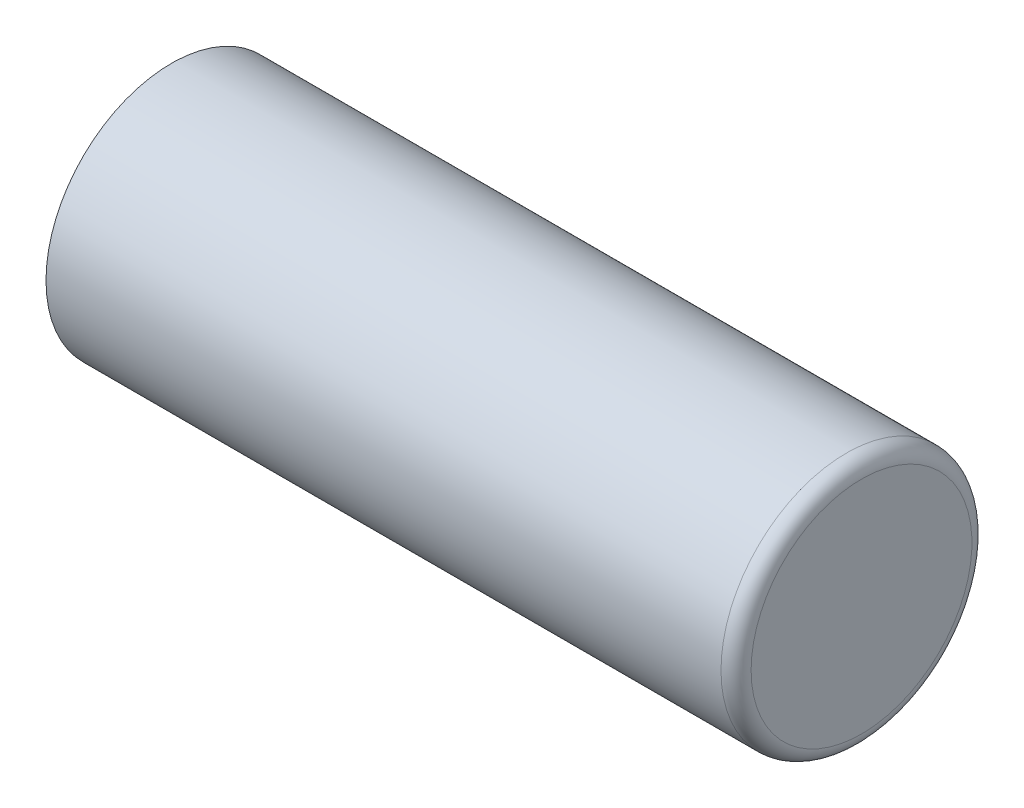
ISO-10303-21;
HEADER;
FILE_DESCRIPTION(('STEP AP214'),'2;1');
FILE_NAME('part.step','',(''),(''),'','','');
FILE_SCHEMA(('AUTOMOTIVE_DESIGN { 1 0 10303 214 1 1 1 1 }'));
ENDSEC;
DATA;
#1=APPLICATION_CONTEXT('core data for automotive mechanical design processes');
#2=APPLICATION_PROTOCOL_DEFINITION('international standard','automotive_design',2000,#1);
#3=PRODUCT_CONTEXT('',#1,'mechanical');
#4=PRODUCT('Part','Part','',(#3));
#5=PRODUCT_RELATED_PRODUCT_CATEGORY('part','',(#4));
#6=PRODUCT_DEFINITION_FORMATION('','',#4);
#7=PRODUCT_DEFINITION_CONTEXT('part definition',#1,'design');
#8=PRODUCT_DEFINITION('design','',#6,#7);
#9=PRODUCT_DEFINITION_SHAPE('','',#8);
#10=(LENGTH_UNIT() NAMED_UNIT(*) SI_UNIT(.MILLI.,.METRE.));
#11=(NAMED_UNIT(*) PLANE_ANGLE_UNIT() SI_UNIT($,.RADIAN.));
#12=(NAMED_UNIT(*) SI_UNIT($,.STERADIAN.) SOLID_ANGLE_UNIT());
#13=UNCERTAINTY_MEASURE_WITH_UNIT(LENGTH_MEASURE(1.E-05),#10,'distance_accuracy_value','');
#14=(GEOMETRIC_REPRESENTATION_CONTEXT(3) GLOBAL_UNCERTAINTY_ASSIGNED_CONTEXT((#13)) GLOBAL_UNIT_ASSIGNED_CONTEXT((#10,
#11,#12)) REPRESENTATION_CONTEXT('',''));
#15=CARTESIAN_POINT('',(0.,0.,0.));
#16=DIRECTION('',(0.,0.,1.));
#17=DIRECTION('',(1.,0.,0.));
#18=AXIS2_PLACEMENT_3D('',#15,#16,#17);
#19=CARTESIAN_POINT('',(0.,0.,-8.00099999999999));
#20=DIRECTION('',(1.,0.,0.));
#21=DIRECTION('',(0.,0.,-1.));
#22=AXIS2_PLACEMENT_3D('',#19,#20,#21);
#23=PLANE('',#22);
#24=CARTESIAN_POINT('',(0.,0.,0.));
#25=DIRECTION('',(-1.,0.,0.));
#26=DIRECTION('',(0.,0.,1.));
#27=AXIS2_PLACEMENT_3D('',#24,#25,#26);
#28=CIRCLE('',#27,8.00099999999999);
#29=CARTESIAN_POINT('',(0.,0.,8.00099999999999));
#30=VERTEX_POINT('',#29);
#31=EDGE_CURVE('E78',#30,#30,#28,.T.);
#32=ORIENTED_EDGE('',*,*,#31,.T.);
#33=EDGE_LOOP('',(#32));
#34=FACE_BOUND('',#33,.T.);
#35=ADVANCED_FACE('F43',(#34),#23,.F.);
#36=CARTESIAN_POINT('',(3.175,0.,0.));
#37=DIRECTION('',(-1.,0.,0.));
#38=DIRECTION('',(0.,0.,1.));
#39=AXIS2_PLACEMENT_3D('',#36,#37,#38);
#40=PLANE('',#39);
#41=CARTESIAN_POINT('',(3.175,0.,0.));
#42=DIRECTION('',(-1.,0.,0.));
#43=DIRECTION('',(0.,0.,1.));
#44=AXIS2_PLACEMENT_3D('',#41,#42,#43);
#45=CIRCLE('',#44,11.176);
#46=CARTESIAN_POINT('',(3.175,0.,11.176));
#47=VERTEX_POINT('',#46);
#48=EDGE_CURVE('E10',#47,#47,#45,.T.);
#49=ORIENTED_EDGE('',*,*,#48,.F.);
#50=EDGE_LOOP('',(#49));
#51=FACE_BOUND('',#50,.T.);
#52=ADVANCED_FACE('F121',(#51),#40,.F.);
#53=CARTESIAN_POINT('',(1.651,0.,0.));
#54=DIRECTION('',(-1.,0.,0.));
#55=DIRECTION('',(0.,0.,1.));
#56=AXIS2_PLACEMENT_3D('',#53,#54,#55);
#57=TOROIDAL_SURFACE('',#56,11.176,1.524);
#58=CARTESIAN_POINT('',(1.65099999999999,0.,0.));
#59=DIRECTION('',(-1.,0.,0.));
#60=DIRECTION('',(0.,0.,1.));
#61=AXIS2_PLACEMENT_3D('',#58,#59,#60);
#62=CIRCLE('',#61,12.7);
#63=CARTESIAN_POINT('',(1.65099999999999,0.,12.7));
#64=VERTEX_POINT('',#63);
#65=EDGE_CURVE('E50',#64,#64,#62,.T.);
#66=ORIENTED_EDGE('',*,*,#65,.F.);
#67=EDGE_LOOP('',(#66));
#68=FACE_BOUND('',#67,.T.);
#69=ORIENTED_EDGE('',*,*,#48,.T.);
#70=EDGE_LOOP('',(#69));
#71=FACE_BOUND('',#70,.T.);
#72=ADVANCED_FACE('F116',(#68,#71),#57,.T.);
#73=CARTESIAN_POINT('',(0.,0.,0.));
#74=DIRECTION('',(-1.,0.,0.));
#75=DIRECTION('',(0.,0.,1.));
#76=AXIS2_PLACEMENT_3D('',#73,#74,#75);
#77=CYLINDRICAL_SURFACE('',#76,12.7);
#78=CARTESIAN_POINT('',(-66.675,0.,0.));
#79=DIRECTION('',(-1.,0.,0.));
#80=DIRECTION('',(0.,0.,1.));
#81=AXIS2_PLACEMENT_3D('',#78,#79,#80);
#82=CIRCLE('',#81,12.7);
#83=CARTESIAN_POINT('',(-66.675,0.,12.7));
#84=VERTEX_POINT('',#83);
#85=EDGE_CURVE('E55',#84,#84,#82,.T.);
#86=ORIENTED_EDGE('',*,*,#85,.F.);
#87=EDGE_LOOP('',(#86));
#88=FACE_BOUND('',#87,.T.);
#89=ORIENTED_EDGE('',*,*,#65,.T.);
#90=EDGE_LOOP('',(#89));
#91=FACE_BOUND('',#90,.T.);
#92=ADVANCED_FACE('F111',(#88,#91),#77,.T.);
#93=CARTESIAN_POINT('',(-66.675,0.,-12.7));
#94=DIRECTION('',(1.,0.,0.));
#95=DIRECTION('',(0.,0.,-1.));
#96=AXIS2_PLACEMENT_3D('',#93,#94,#95);
#97=PLANE('',#96);
#98=CARTESIAN_POINT('',(-66.675,0.,0.));
#99=DIRECTION('',(-1.,0.,0.));
#100=DIRECTION('',(0.,0.,1.));
#101=AXIS2_PLACEMENT_3D('',#98,#99,#100);
#102=CIRCLE('',#101,11.1125);
#103=CARTESIAN_POINT('',(-66.675,0.,11.1125));
#104=VERTEX_POINT('',#103);
#105=EDGE_CURVE('E60',#104,#104,#102,.T.);
#106=ORIENTED_EDGE('',*,*,#105,.F.);
#107=EDGE_LOOP('',(#106));
#108=FACE_BOUND('',#107,.T.);
#109=ORIENTED_EDGE('',*,*,#85,.T.);
#110=EDGE_LOOP('',(#109));
#111=FACE_BOUND('',#110,.T.);
#112=ADVANCED_FACE('F105',(#108,#111),#97,.F.);
#113=CARTESIAN_POINT('',(0.,0.,0.));
#114=DIRECTION('',(-1.,0.,0.));
#115=DIRECTION('',(0.,0.,1.));
#116=AXIS2_PLACEMENT_3D('',#113,#114,#115);
#117=CYLINDRICAL_SURFACE('',#116,11.1125);
#118=CARTESIAN_POINT('',(-65.0748,0.,0.));
#119=DIRECTION('',(-1.,0.,0.));
#120=DIRECTION('',(0.,0.,1.));
#121=AXIS2_PLACEMENT_3D('',#118,#119,#120);
#122=CIRCLE('',#121,11.1125);
#123=CARTESIAN_POINT('',(-65.0748,0.,11.1125));
#124=VERTEX_POINT('',#123);
#125=EDGE_CURVE('E66',#124,#124,#122,.T.);
#126=ORIENTED_EDGE('',*,*,#125,.F.);
#127=EDGE_LOOP('',(#126));
#128=FACE_BOUND('',#127,.T.);
#129=ORIENTED_EDGE('',*,*,#105,.T.);
#130=EDGE_LOOP('',(#129));
#131=FACE_BOUND('',#130,.T.);
#132=ADVANCED_FACE('F99',(#128,#131),#117,.F.);
#133=CARTESIAN_POINT('',(-65.0748,0.,-11.1125));
#134=DIRECTION('',(1.,0.,0.));
#135=DIRECTION('',(0.,0.,-1.));
#136=AXIS2_PLACEMENT_3D('',#133,#134,#135);
#137=PLANE('',#136);
#138=CARTESIAN_POINT('',(-65.0748,0.,0.));
#139=DIRECTION('',(-1.,0.,0.));
#140=DIRECTION('',(0.,0.,1.));
#141=AXIS2_PLACEMENT_3D('',#138,#139,#140);
#142=CIRCLE('',#141,9.525);
#143=CARTESIAN_POINT('',(-65.0748,0.,9.525));
#144=VERTEX_POINT('',#143);
#145=EDGE_CURVE('E70',#144,#144,#142,.T.);
#146=ORIENTED_EDGE('',*,*,#145,.F.);
#147=EDGE_LOOP('',(#146));
#148=FACE_BOUND('',#147,.T.);
#149=ORIENTED_EDGE('',*,*,#125,.T.);
#150=EDGE_LOOP('',(#149));
#151=FACE_BOUND('',#150,.T.);
#152=ADVANCED_FACE('F93',(#148,#151),#137,.F.);
#153=CARTESIAN_POINT('',(0.,0.,0.));
#154=DIRECTION('',(-1.,0.,0.));
#155=DIRECTION('',(0.,0.,1.));
#156=AXIS2_PLACEMENT_3D('',#153,#154,#155);
#157=CYLINDRICAL_SURFACE('',#156,9.525);
#158=CARTESIAN_POINT('',(-1.52400000000001,0.,0.));
#159=DIRECTION('',(-1.,0.,0.));
#160=DIRECTION('',(0.,0.,1.));
#161=AXIS2_PLACEMENT_3D('',#158,#159,#160);
#162=CIRCLE('',#161,9.525);
#163=CARTESIAN_POINT('',(-1.52400000000001,0.,9.525));
#164=VERTEX_POINT('',#163);
#165=EDGE_CURVE('E74',#164,#164,#162,.T.);
#166=ORIENTED_EDGE('',*,*,#165,.F.);
#167=EDGE_LOOP('',(#166));
#168=FACE_BOUND('',#167,.T.);
#169=ORIENTED_EDGE('',*,*,#145,.T.);
#170=EDGE_LOOP('',(#169));
#171=FACE_BOUND('',#170,.T.);
#172=ADVANCED_FACE('F87',(#168,#171),#157,.F.);
#173=CARTESIAN_POINT('',(-1.524,0.,0.));
#174=DIRECTION('',(-1.,0.,0.));
#175=DIRECTION('',(0.,0.,1.));
#176=AXIS2_PLACEMENT_3D('',#173,#174,#175);
#177=TOROIDAL_SURFACE('',#176,8.001,1.524);
#178=ORIENTED_EDGE('',*,*,#31,.F.);
#179=EDGE_LOOP('',(#178));
#180=FACE_BOUND('',#179,.T.);
#181=ORIENTED_EDGE('',*,*,#165,.T.);
#182=EDGE_LOOP('',(#181));
#183=FACE_BOUND('',#182,.T.);
#184=ADVANCED_FACE('F84',(#180,#183),#177,.F.);
#185=CLOSED_SHELL('',(#35,#52,#72,#92,#112,#132,#152,#172,#184));
#186=MANIFOLD_SOLID_BREP('B2',#185);
#187=ADVANCED_BREP_SHAPE_REPRESENTATION('',(#18,#186),#14);
#188=SHAPE_DEFINITION_REPRESENTATION(#9,#187);
ENDSEC;
END-ISO-10303-21;
